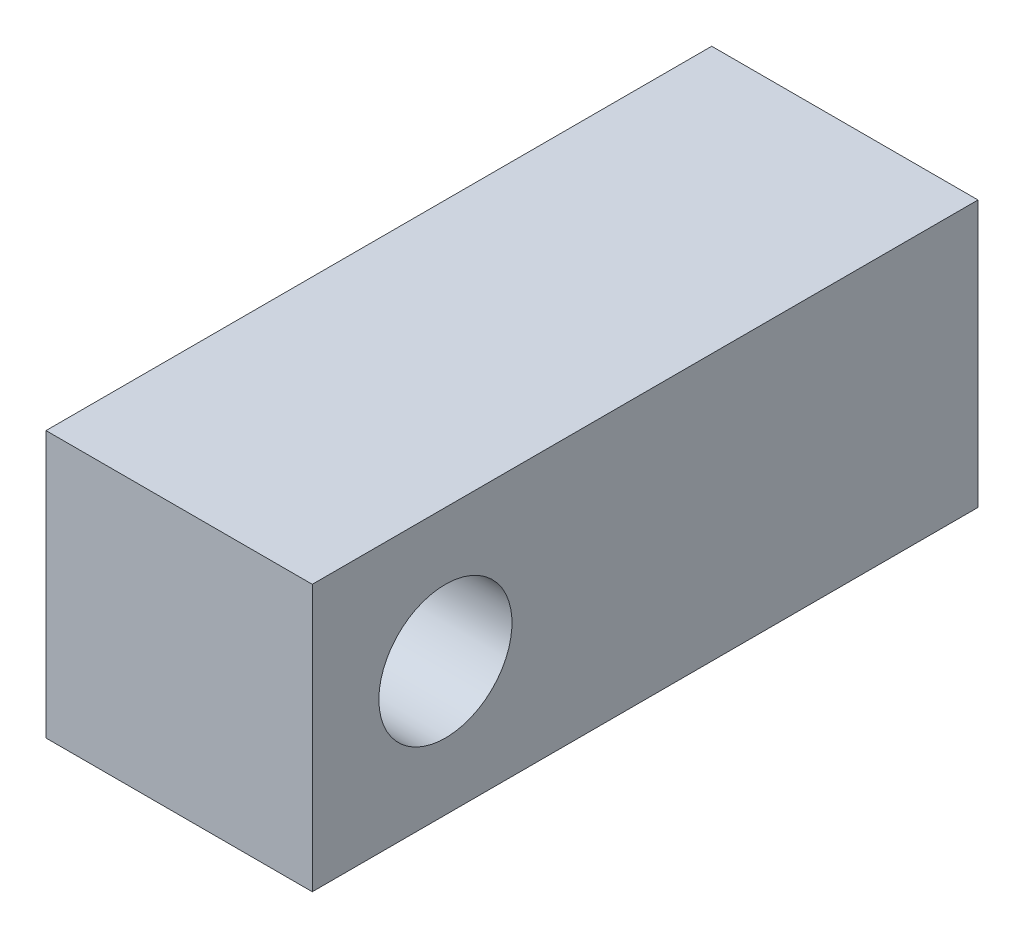
ISO-10303-21;
HEADER;
FILE_DESCRIPTION(('STEP AP214'),'2;1');
FILE_NAME('part.step','',(''),(''),'','','');
FILE_SCHEMA(('AUTOMOTIVE_DESIGN { 1 0 10303 214 1 1 1 1 }'));
ENDSEC;
DATA;
#1=APPLICATION_CONTEXT('core data for automotive mechanical design processes');
#2=APPLICATION_PROTOCOL_DEFINITION('international standard','automotive_design',2000,#1);
#3=PRODUCT_CONTEXT('',#1,'mechanical');
#4=PRODUCT('Part','Part','',(#3));
#5=PRODUCT_RELATED_PRODUCT_CATEGORY('part','',(#4));
#6=PRODUCT_DEFINITION_FORMATION('','',#4);
#7=PRODUCT_DEFINITION_CONTEXT('part definition',#1,'design');
#8=PRODUCT_DEFINITION('design','',#6,#7);
#9=PRODUCT_DEFINITION_SHAPE('','',#8);
#10=(LENGTH_UNIT() NAMED_UNIT(*) SI_UNIT(.MILLI.,.METRE.));
#11=(NAMED_UNIT(*) PLANE_ANGLE_UNIT() SI_UNIT($,.RADIAN.));
#12=(NAMED_UNIT(*) SI_UNIT($,.STERADIAN.) SOLID_ANGLE_UNIT());
#13=UNCERTAINTY_MEASURE_WITH_UNIT(LENGTH_MEASURE(1.E-05),#10,'distance_accuracy_value','');
#14=(GEOMETRIC_REPRESENTATION_CONTEXT(3) GLOBAL_UNCERTAINTY_ASSIGNED_CONTEXT((#13)) GLOBAL_UNIT_ASSIGNED_CONTEXT((#10,
#11,#12)) REPRESENTATION_CONTEXT('',''));
#15=CARTESIAN_POINT('',(0.,0.,0.));
#16=DIRECTION('',(0.,0.,1.));
#17=DIRECTION('',(1.,0.,0.));
#18=AXIS2_PLACEMENT_3D('',#15,#16,#17);
#19=CARTESIAN_POINT('',(-4.36449132059234,7.64216366576686,63.5));
#20=DIRECTION('',(-1.,0.,0.));
#21=DIRECTION('',(0.,0.,1.));
#22=AXIS2_PLACEMENT_3D('',#19,#20,#21);
#23=PLANE('',#22);
#24=CARTESIAN_POINT('',(-4.36449132059234,20.3421636657669,50.8));
#25=DIRECTION('',(-1.,0.,0.));
#26=DIRECTION('',(0.,0.,1.));
#27=AXIS2_PLACEMENT_3D('',#24,#25,#26);
#28=CIRCLE('',#27,6.35);
#29=CARTESIAN_POINT('',(-4.36449132059234,20.3421636657669,57.15));
#30=VERTEX_POINT('',#29);
#31=EDGE_CURVE('E120',#30,#30,#28,.T.);
#32=ORIENTED_EDGE('',*,*,#31,.T.);
#33=EDGE_LOOP('',(#32));
#34=FACE_BOUND('',#33,.T.);
#35=DIRECTION('',(0.,1.,0.));
#36=VECTOR('',#35,1.);
#37=CARTESIAN_POINT('',(-4.36449132059234,7.64216366576686,0.));
#38=LINE('',#37,#36);
#39=CARTESIAN_POINT('',(-4.36449132059234,7.64216366576686,0.));
#40=VERTEX_POINT('',#39);
#41=CARTESIAN_POINT('',(-4.36449132059234,33.0421636657669,0.));
#42=VERTEX_POINT('',#41);
#43=EDGE_CURVE('E116',#40,#42,#38,.T.);
#44=ORIENTED_EDGE('',*,*,#43,.T.);
#45=DIRECTION('',(0.,0.,-1.));
#46=VECTOR('',#45,1.);
#47=CARTESIAN_POINT('',(-4.36449132059234,33.0421636657669,63.5));
#48=LINE('',#47,#46);
#49=CARTESIAN_POINT('',(-4.36449132059234,33.0421636657669,63.5));
#50=VERTEX_POINT('',#49);
#51=EDGE_CURVE('E11',#50,#42,#48,.T.);
#52=ORIENTED_EDGE('',*,*,#51,.F.);
#53=DIRECTION('',(0.,1.,0.));
#54=VECTOR('',#53,1.);
#55=CARTESIAN_POINT('',(-4.36449132059234,7.64216366576686,63.5));
#56=LINE('',#55,#54);
#57=CARTESIAN_POINT('',(-4.36449132059234,7.64216366576686,63.5));
#58=VERTEX_POINT('',#57);
#59=EDGE_CURVE('E100',#58,#50,#56,.T.);
#60=ORIENTED_EDGE('',*,*,#59,.F.);
#61=DIRECTION('',(0.,0.,-1.));
#62=VECTOR('',#61,1.);
#63=CARTESIAN_POINT('',(-4.36449132059234,7.64216366576686,63.5));
#64=LINE('',#63,#62);
#65=EDGE_CURVE('E112',#58,#40,#64,.T.);
#66=ORIENTED_EDGE('',*,*,#65,.T.);
#67=EDGE_LOOP('',(#44,#52,#60,#66));
#68=FACE_BOUND('',#67,.T.);
#69=ADVANCED_FACE('F40',(#34,#68),#23,.F.);
#70=CARTESIAN_POINT('',(-4.36449132059234,33.0421636657669,63.5));
#71=DIRECTION('',(0.,-1.,0.));
#72=DIRECTION('',(0.,0.,-1.));
#73=AXIS2_PLACEMENT_3D('',#70,#71,#72);
#74=PLANE('',#73);
#75=DIRECTION('',(-1.,0.,0.));
#76=VECTOR('',#75,1.);
#77=CARTESIAN_POINT('',(-4.36449132059234,33.0421636657669,0.));
#78=LINE('',#77,#76);
#79=CARTESIAN_POINT('',(-29.7644913205923,33.0421636657669,0.));
#80=VERTEX_POINT('',#79);
#81=EDGE_CURVE('E105',#42,#80,#78,.T.);
#82=ORIENTED_EDGE('',*,*,#81,.T.);
#83=DIRECTION('',(0.,0.,-1.));
#84=VECTOR('',#83,1.);
#85=CARTESIAN_POINT('',(-29.7644913205923,33.0421636657669,63.5));
#86=LINE('',#85,#84);
#87=CARTESIAN_POINT('',(-29.7644913205923,33.0421636657669,63.5));
#88=VERTEX_POINT('',#87);
#89=EDGE_CURVE('E49',#88,#80,#86,.T.);
#90=ORIENTED_EDGE('',*,*,#89,.F.);
#91=DIRECTION('',(-1.,0.,0.));
#92=VECTOR('',#91,1.);
#93=CARTESIAN_POINT('',(-4.36449132059234,33.0421636657669,63.5));
#94=LINE('',#93,#92);
#95=EDGE_CURVE('E95',#50,#88,#94,.T.);
#96=ORIENTED_EDGE('',*,*,#95,.F.);
#97=ORIENTED_EDGE('',*,*,#51,.T.);
#98=EDGE_LOOP('',(#82,#90,#96,#97));
#99=FACE_BOUND('',#98,.T.);
#100=ADVANCED_FACE('F104',(#99),#74,.F.);
#101=CARTESIAN_POINT('',(-29.7644913205923,7.64216366576685,63.5));
#102=DIRECTION('',(1.,0.,0.));
#103=DIRECTION('',(0.,0.,-1.));
#104=AXIS2_PLACEMENT_3D('',#101,#102,#103);
#105=PLANE('',#104);
#106=CARTESIAN_POINT('',(-29.7644913205923,20.3421636657669,50.8));
#107=DIRECTION('',(-1.,0.,0.));
#108=DIRECTION('',(0.,0.,1.));
#109=AXIS2_PLACEMENT_3D('',#106,#107,#108);
#110=CIRCLE('',#109,6.35);
#111=CARTESIAN_POINT('',(-29.7644913205923,20.3421636657669,57.15));
#112=VERTEX_POINT('',#111);
#113=EDGE_CURVE('E137',#112,#112,#110,.T.);
#114=ORIENTED_EDGE('',*,*,#113,.F.);
#115=EDGE_LOOP('',(#114));
#116=FACE_BOUND('',#115,.T.);
#117=DIRECTION('',(0.,-1.,0.));
#118=VECTOR('',#117,1.);
#119=CARTESIAN_POINT('',(-29.7644913205923,7.64216366576685,0.));
#120=LINE('',#119,#118);
#121=CARTESIAN_POINT('',(-29.7644913205923,7.64216366576685,0.));
#122=VERTEX_POINT('',#121);
#123=EDGE_CURVE('E80',#80,#122,#120,.T.);
#124=ORIENTED_EDGE('',*,*,#123,.T.);
#125=DIRECTION('',(0.,0.,-1.));
#126=VECTOR('',#125,1.);
#127=CARTESIAN_POINT('',(-29.7644913205923,7.64216366576685,63.5));
#128=LINE('',#127,#126);
#129=CARTESIAN_POINT('',(-29.7644913205923,7.64216366576685,63.5));
#130=VERTEX_POINT('',#129);
#131=EDGE_CURVE('E107',#130,#122,#128,.T.);
#132=ORIENTED_EDGE('',*,*,#131,.F.);
#133=DIRECTION('',(0.,-1.,0.));
#134=VECTOR('',#133,1.);
#135=CARTESIAN_POINT('',(-29.7644913205923,7.64216366576685,63.5));
#136=LINE('',#135,#134);
#137=EDGE_CURVE('E98',#88,#130,#136,.T.);
#138=ORIENTED_EDGE('',*,*,#137,.F.);
#139=ORIENTED_EDGE('',*,*,#89,.T.);
#140=EDGE_LOOP('',(#124,#132,#138,#139));
#141=FACE_BOUND('',#140,.T.);
#142=ADVANCED_FACE('F108',(#116,#141),#105,.F.);
#143=CARTESIAN_POINT('',(-4.36449132059234,7.64216366576686,63.5));
#144=DIRECTION('',(0.,1.,0.));
#145=DIRECTION('',(-1.,0.,0.));
#146=AXIS2_PLACEMENT_3D('',#143,#144,#145);
#147=PLANE('',#146);
#148=DIRECTION('',(1.,0.,0.));
#149=VECTOR('',#148,1.);
#150=CARTESIAN_POINT('',(-4.36449132059234,7.64216366576686,0.));
#151=LINE('',#150,#149);
#152=EDGE_CURVE('E87',#122,#40,#151,.T.);
#153=ORIENTED_EDGE('',*,*,#152,.T.);
#154=ORIENTED_EDGE('',*,*,#65,.F.);
#155=DIRECTION('',(1.,0.,0.));
#156=VECTOR('',#155,1.);
#157=CARTESIAN_POINT('',(-4.36449132059234,7.64216366576686,63.5));
#158=LINE('',#157,#156);
#159=EDGE_CURVE('E60',#130,#58,#158,.T.);
#160=ORIENTED_EDGE('',*,*,#159,.F.);
#161=ORIENTED_EDGE('',*,*,#131,.T.);
#162=EDGE_LOOP('',(#153,#154,#160,#161));
#163=FACE_BOUND('',#162,.T.);
#164=ADVANCED_FACE('F130',(#163),#147,.F.);
#165=CARTESIAN_POINT('',(0.,0.,63.5));
#166=DIRECTION('',(0.,0.,1.));
#167=DIRECTION('',(1.,0.,0.));
#168=AXIS2_PLACEMENT_3D('',#165,#166,#167);
#169=PLANE('',#168);
#170=ORIENTED_EDGE('',*,*,#59,.T.);
#171=ORIENTED_EDGE('',*,*,#95,.T.);
#172=ORIENTED_EDGE('',*,*,#137,.T.);
#173=ORIENTED_EDGE('',*,*,#159,.T.);
#174=EDGE_LOOP('',(#170,#171,#172,#173));
#175=FACE_BOUND('',#174,.T.);
#176=ADVANCED_FACE('F96',(#175),#169,.T.);
#177=CARTESIAN_POINT('',(0.,0.,0.));
#178=DIRECTION('',(0.,0.,1.));
#179=DIRECTION('',(1.,0.,0.));
#180=AXIS2_PLACEMENT_3D('',#177,#178,#179);
#181=PLANE('',#180);
#182=ORIENTED_EDGE('',*,*,#43,.F.);
#183=ORIENTED_EDGE('',*,*,#152,.F.);
#184=ORIENTED_EDGE('',*,*,#123,.F.);
#185=ORIENTED_EDGE('',*,*,#81,.F.);
#186=EDGE_LOOP('',(#182,#183,#184,#185));
#187=FACE_BOUND('',#186,.T.);
#188=ADVANCED_FACE('F133',(#187),#181,.F.);
#189=CARTESIAN_POINT('',(-4.36449132059234,20.3421636657669,50.8));
#190=DIRECTION('',(-1.,0.,0.));
#191=DIRECTION('',(0.,0.,1.));
#192=AXIS2_PLACEMENT_3D('',#189,#190,#191);
#193=CYLINDRICAL_SURFACE('',#192,6.35);
#194=ORIENTED_EDGE('',*,*,#31,.F.);
#195=EDGE_LOOP('',(#194));
#196=FACE_BOUND('',#195,.T.);
#197=ORIENTED_EDGE('',*,*,#113,.T.);
#198=EDGE_LOOP('',(#197));
#199=FACE_BOUND('',#198,.T.);
#200=ADVANCED_FACE('F146',(#196,#199),#193,.F.);
#201=CLOSED_SHELL('',(#69,#100,#142,#164,#176,#188,#200));
#202=MANIFOLD_SOLID_BREP('B2',#201);
#203=ADVANCED_BREP_SHAPE_REPRESENTATION('',(#18,#202),#14);
#204=SHAPE_DEFINITION_REPRESENTATION(#9,#203);
ENDSEC;
END-ISO-10303-21;
